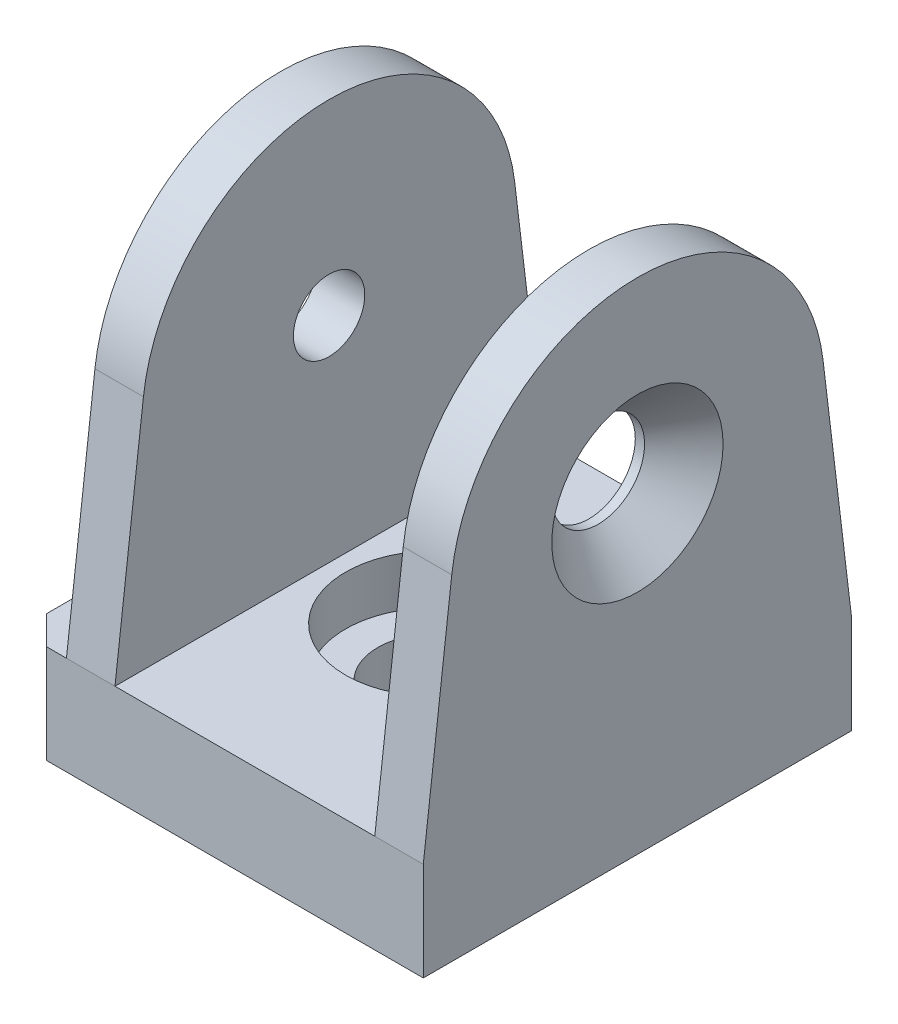
ISO-10303-21;
HEADER;
FILE_DESCRIPTION(('STEP AP214'),'2;1');
FILE_NAME('part.step','',(''),(''),'','','');
FILE_SCHEMA(('AUTOMOTIVE_DESIGN { 1 0 10303 214 1 1 1 1 }'));
ENDSEC;
DATA;
#1=APPLICATION_CONTEXT('core data for automotive mechanical design processes');
#2=APPLICATION_PROTOCOL_DEFINITION('international standard','automotive_design',2000,#1);
#3=PRODUCT_CONTEXT('',#1,'mechanical');
#4=PRODUCT('Part','Part','',(#3));
#5=PRODUCT_RELATED_PRODUCT_CATEGORY('part','',(#4));
#6=PRODUCT_DEFINITION_FORMATION('','',#4);
#7=PRODUCT_DEFINITION_CONTEXT('part definition',#1,'design');
#8=PRODUCT_DEFINITION('design','',#6,#7);
#9=PRODUCT_DEFINITION_SHAPE('','',#8);
#10=(LENGTH_UNIT() NAMED_UNIT(*) SI_UNIT(.MILLI.,.METRE.));
#11=(NAMED_UNIT(*) PLANE_ANGLE_UNIT() SI_UNIT($,.RADIAN.));
#12=(NAMED_UNIT(*) SI_UNIT($,.STERADIAN.) SOLID_ANGLE_UNIT());
#13=UNCERTAINTY_MEASURE_WITH_UNIT(LENGTH_MEASURE(1.E-05),#10,'distance_accuracy_value','');
#14=(GEOMETRIC_REPRESENTATION_CONTEXT(3) GLOBAL_UNCERTAINTY_ASSIGNED_CONTEXT((#13)) GLOBAL_UNIT_ASSIGNED_CONTEXT((#10,
#11,#12)) REPRESENTATION_CONTEXT('',''));
#15=CARTESIAN_POINT('',(0.,0.,0.));
#16=DIRECTION('',(0.,0.,1.));
#17=DIRECTION('',(1.,0.,0.));
#18=AXIS2_PLACEMENT_3D('',#15,#16,#17);
#19=CARTESIAN_POINT('',(-10.8,23.4654601413375,-13.0061268080041));
#20=DIRECTION('',(0.,0.119500774147898,-0.992834107481231));
#21=DIRECTION('',(0.,0.992834107481231,0.119500774147898));
#22=AXIS2_PLACEMENT_3D('',#19,#20,#21);
#23=PLANE('',#22);
#24=DIRECTION('',(0.,-0.992834107481231,-0.119500774147898));
#25=VECTOR('',#24,1.);
#26=CARTESIAN_POINT('',(10.8,23.4654601413375,-13.0061268080041));
#27=LINE('',#26,#25);
#28=CARTESIAN_POINT('',(10.8,23.4654601413374,-13.0061268080041));
#29=VERTEX_POINT('',#28);
#30=CARTESIAN_POINT('',(10.8,6.9,-15.));
#31=VERTEX_POINT('',#30);
#32=EDGE_CURVE('E144',#29,#31,#27,.T.);
#33=ORIENTED_EDGE('',*,*,#32,.F.);
#34=DIRECTION('',(1.,0.,0.));
#35=VECTOR('',#34,1.);
#36=CARTESIAN_POINT('',(-10.8,23.4654601413374,-13.0061268080041));
#37=LINE('',#36,#35);
#38=CARTESIAN_POINT('',(14.2,23.4654601413374,-13.0061268080041));
#39=VERTEX_POINT('',#38);
#40=EDGE_CURVE('E189',#29,#39,#37,.T.);
#41=ORIENTED_EDGE('',*,*,#40,.T.);
#42=DIRECTION('',(0.,0.992834107481231,0.119500774147898));
#43=VECTOR('',#42,1.);
#44=CARTESIAN_POINT('',(14.2,23.4654601413375,-13.0061268080041));
#45=LINE('',#44,#43);
#46=CARTESIAN_POINT('',(14.2,6.9,-15.));
#47=VERTEX_POINT('',#46);
#48=EDGE_CURVE('E257',#47,#39,#45,.T.);
#49=ORIENTED_EDGE('',*,*,#48,.F.);
#50=DIRECTION('',(-1.,0.,0.));
#51=VECTOR('',#50,1.);
#52=CARTESIAN_POINT('',(14.2,6.9,-15.));
#53=LINE('',#52,#51);
#54=EDGE_CURVE('E210',#47,#31,#53,.T.);
#55=ORIENTED_EDGE('',*,*,#54,.T.);
#56=EDGE_LOOP('',(#33,#41,#49,#55));
#57=FACE_BOUND('',#56,.T.);
#58=ADVANCED_FACE('F38',(#57),#23,.T.);
#59=CARTESIAN_POINT('',(-10.8,21.9,0.));
#60=DIRECTION('',(1.,0.,0.));
#61=DIRECTION('',(0.,0.,-1.));
#62=AXIS2_PLACEMENT_3D('',#59,#60,#61);
#63=CYLINDRICAL_SURFACE('',#62,13.1);
#64=DIRECTION('',(1.,0.,0.));
#65=VECTOR('',#64,1.);
#66=CARTESIAN_POINT('',(-10.8,23.4654601413375,13.0061268080041));
#67=LINE('',#66,#65);
#68=CARTESIAN_POINT('',(-10.8,23.4654601413375,13.0061268080041));
#69=VERTEX_POINT('',#68);
#70=CARTESIAN_POINT('',(-7.4,23.4654601413375,13.0061268080041));
#71=VERTEX_POINT('',#70);
#72=EDGE_CURVE('E177',#69,#71,#67,.T.);
#73=ORIENTED_EDGE('',*,*,#72,.T.);
#74=CARTESIAN_POINT('',(-7.4,21.9,0.));
#75=DIRECTION('',(-1.,0.,0.));
#76=DIRECTION('',(0.,-1.,0.));
#77=AXIS2_PLACEMENT_3D('',#74,#75,#76);
#78=CIRCLE('',#77,13.1);
#79=CARTESIAN_POINT('',(-7.4,23.4654601413374,-13.0061268080041));
#80=VERTEX_POINT('',#79);
#81=EDGE_CURVE('E148',#80,#71,#78,.F.);
#82=ORIENTED_EDGE('',*,*,#81,.F.);
#83=CARTESIAN_POINT('',(-10.8,23.4654601413374,-13.0061268080041));
#84=VERTEX_POINT('',#83);
#85=EDGE_CURVE('E186',#84,#80,#37,.T.);
#86=ORIENTED_EDGE('',*,*,#85,.F.);
#87=CARTESIAN_POINT('',(-10.8,21.9,0.));
#88=DIRECTION('',(1.,0.,0.));
#89=DIRECTION('',(0.,0.,1.));
#90=AXIS2_PLACEMENT_3D('',#87,#88,#89);
#91=CIRCLE('',#90,13.1);
#92=EDGE_CURVE('E312',#84,#69,#91,.T.);
#93=ORIENTED_EDGE('',*,*,#92,.T.);
#94=EDGE_LOOP('',(#73,#82,#86,#93));
#95=FACE_BOUND('',#94,.T.);
#96=ADVANCED_FACE('F272',(#95),#63,.T.);
#97=CARTESIAN_POINT('',(-10.8,6.9,15.));
#98=DIRECTION('',(0.,0.119500774147897,0.992834107481231));
#99=DIRECTION('',(0.,-0.992834107481231,0.119500774147897));
#100=AXIS2_PLACEMENT_3D('',#97,#98,#99);
#101=PLANE('',#100);
#102=DIRECTION('',(0.,0.992834107481231,-0.119500774147897));
#103=VECTOR('',#102,1.);
#104=CARTESIAN_POINT('',(10.8,6.9,15.));
#105=LINE('',#104,#103);
#106=CARTESIAN_POINT('',(10.8,6.9,15.));
#107=VERTEX_POINT('',#106);
#108=CARTESIAN_POINT('',(10.8,23.4654601413375,13.0061268080041));
#109=VERTEX_POINT('',#108);
#110=EDGE_CURVE('E141',#107,#109,#105,.T.);
#111=ORIENTED_EDGE('',*,*,#110,.F.);
#112=DIRECTION('',(1.,0.,0.));
#113=VECTOR('',#112,1.);
#114=CARTESIAN_POINT('',(-10.8,6.9,15.));
#115=LINE('',#114,#113);
#116=CARTESIAN_POINT('',(14.2,6.9,15.));
#117=VERTEX_POINT('',#116);
#118=EDGE_CURVE('E166',#107,#117,#115,.T.);
#119=ORIENTED_EDGE('',*,*,#118,.T.);
#120=DIRECTION('',(0.,-0.992834107481231,0.119500774147897));
#121=VECTOR('',#120,1.);
#122=CARTESIAN_POINT('',(14.2,6.9,15.));
#123=LINE('',#122,#121);
#124=CARTESIAN_POINT('',(14.2,23.4654601413375,13.0061268080041));
#125=VERTEX_POINT('',#124);
#126=EDGE_CURVE('E183',#125,#117,#123,.T.);
#127=ORIENTED_EDGE('',*,*,#126,.F.);
#128=EDGE_CURVE('E168',#109,#125,#67,.T.);
#129=ORIENTED_EDGE('',*,*,#128,.F.);
#130=EDGE_LOOP('',(#111,#119,#127,#129));
#131=FACE_BOUND('',#130,.T.);
#132=ADVANCED_FACE('F164',(#131),#101,.T.);
#133=CARTESIAN_POINT('',(0.,6.9,0.));
#134=DIRECTION('',(0.,1.,0.));
#135=DIRECTION('',(0.,0.,1.));
#136=AXIS2_PLACEMENT_3D('',#133,#134,#135);
#137=PLANE('',#136);
#138=CARTESIAN_POINT('',(-10.8,6.9,-15.));
#139=VERTEX_POINT('',#138);
#140=CARTESIAN_POINT('',(-12.2,6.9,-15.));
#141=VERTEX_POINT('',#140);
#142=EDGE_CURVE('E209',#139,#141,#53,.T.);
#143=ORIENTED_EDGE('',*,*,#142,.T.);
#144=DIRECTION('',(0.707106781186549,0.,-0.707106781186546));
#145=VECTOR('',#144,1.);
#146=CARTESIAN_POINT('',(-13.6,6.9,-13.6));
#147=LINE('',#146,#145);
#148=CARTESIAN_POINT('',(-14.2,6.9,-13.));
#149=VERTEX_POINT('',#148);
#150=EDGE_CURVE('E47',#141,#149,#147,.F.);
#151=ORIENTED_EDGE('',*,*,#150,.T.);
#152=DIRECTION('',(0.,0.,1.));
#153=VECTOR('',#152,1.);
#154=CARTESIAN_POINT('',(-14.2,6.9,15.));
#155=LINE('',#154,#153);
#156=CARTESIAN_POINT('',(-14.2,6.9,13.));
#157=VERTEX_POINT('',#156);
#158=EDGE_CURVE('E204',#149,#157,#155,.T.);
#159=ORIENTED_EDGE('',*,*,#158,.T.);
#160=DIRECTION('',(-0.707106781186547,0.,-0.707106781186548));
#161=VECTOR('',#160,1.);
#162=CARTESIAN_POINT('',(-13.6,6.9,13.6));
#163=LINE('',#162,#161);
#164=CARTESIAN_POINT('',(-12.2,6.9,15.));
#165=VERTEX_POINT('',#164);
#166=EDGE_CURVE('E54',#157,#165,#163,.F.);
#167=ORIENTED_EDGE('',*,*,#166,.T.);
#168=DIRECTION('',(1.,0.,0.));
#169=VECTOR('',#168,1.);
#170=CARTESIAN_POINT('',(14.2,6.9,15.));
#171=LINE('',#170,#169);
#172=CARTESIAN_POINT('',(-10.8,6.9,15.));
#173=VERTEX_POINT('',#172);
#174=EDGE_CURVE('E206',#165,#173,#171,.T.);
#175=ORIENTED_EDGE('',*,*,#174,.T.);
#176=DIRECTION('',(0.,0.,-1.));
#177=VECTOR('',#176,1.);
#178=CARTESIAN_POINT('',(-10.8,6.9,-15.));
#179=LINE('',#178,#177);
#180=EDGE_CURVE('E317',#173,#139,#179,.T.);
#181=ORIENTED_EDGE('',*,*,#180,.T.);
#182=EDGE_LOOP('',(#143,#151,#159,#167,#175,#181));
#183=FACE_BOUND('',#182,.T.);
#184=ADVANCED_FACE('F237',(#183),#137,.T.);
#185=CARTESIAN_POINT('',(-14.2,6.9,15.));
#186=DIRECTION('',(1.,0.,0.));
#187=DIRECTION('',(0.,0.,-1.));
#188=AXIS2_PLACEMENT_3D('',#185,#186,#187);
#189=PLANE('',#188);
#190=ORIENTED_EDGE('',*,*,#158,.F.);
#191=DIRECTION('',(0.,-1.,0.));
#192=VECTOR('',#191,1.);
#193=CARTESIAN_POINT('',(-14.2,6.9,-13.));
#194=LINE('',#193,#192);
#195=CARTESIAN_POINT('',(-14.2,0.,-13.));
#196=VERTEX_POINT('',#195);
#197=EDGE_CURVE('E227',#149,#196,#194,.T.);
#198=ORIENTED_EDGE('',*,*,#197,.T.);
#199=DIRECTION('',(0.,0.,1.));
#200=VECTOR('',#199,1.);
#201=CARTESIAN_POINT('',(-14.2,0.,15.));
#202=LINE('',#201,#200);
#203=CARTESIAN_POINT('',(-14.2,0.,13.));
#204=VERTEX_POINT('',#203);
#205=EDGE_CURVE('E203',#196,#204,#202,.T.);
#206=ORIENTED_EDGE('',*,*,#205,.T.);
#207=DIRECTION('',(0.,1.,0.));
#208=VECTOR('',#207,1.);
#209=CARTESIAN_POINT('',(-14.2,6.9,13.));
#210=LINE('',#209,#208);
#211=EDGE_CURVE('E169',#204,#157,#210,.T.);
#212=ORIENTED_EDGE('',*,*,#211,.T.);
#213=EDGE_LOOP('',(#190,#198,#206,#212));
#214=FACE_BOUND('',#213,.T.);
#215=ADVANCED_FACE('F242',(#214),#189,.F.);
#216=CARTESIAN_POINT('',(14.2,6.9,15.));
#217=DIRECTION('',(0.,0.,-1.));
#218=DIRECTION('',(-1.,0.,0.));
#219=AXIS2_PLACEMENT_3D('',#216,#217,#218);
#220=PLANE('',#219);
#221=ORIENTED_EDGE('',*,*,#174,.F.);
#222=DIRECTION('',(0.,-1.,0.));
#223=VECTOR('',#222,1.);
#224=CARTESIAN_POINT('',(-12.2,6.9,15.));
#225=LINE('',#224,#223);
#226=CARTESIAN_POINT('',(-12.2,0.,15.));
#227=VERTEX_POINT('',#226);
#228=EDGE_CURVE('E11',#165,#227,#225,.T.);
#229=ORIENTED_EDGE('',*,*,#228,.T.);
#230=DIRECTION('',(1.,0.,0.));
#231=VECTOR('',#230,1.);
#232=CARTESIAN_POINT('',(14.2,0.,15.));
#233=LINE('',#232,#231);
#234=CARTESIAN_POINT('',(14.2,0.,15.));
#235=VERTEX_POINT('',#234);
#236=EDGE_CURVE('E217',#227,#235,#233,.T.);
#237=ORIENTED_EDGE('',*,*,#236,.T.);
#238=DIRECTION('',(0.,-1.,0.));
#239=VECTOR('',#238,1.);
#240=CARTESIAN_POINT('',(14.2,6.9,15.));
#241=LINE('',#240,#239);
#242=EDGE_CURVE('E175',#117,#235,#241,.T.);
#243=ORIENTED_EDGE('',*,*,#242,.F.);
#244=ORIENTED_EDGE('',*,*,#118,.F.);
#245=DIRECTION('',(1.,0.,0.));
#246=VECTOR('',#245,1.);
#247=CARTESIAN_POINT('',(10.8,6.9,15.));
#248=LINE('',#247,#246);
#249=CARTESIAN_POINT('',(-7.4,6.9,15.));
#250=VERTEX_POINT('',#249);
#251=EDGE_CURVE('E152',#250,#107,#248,.T.);
#252=ORIENTED_EDGE('',*,*,#251,.F.);
#253=EDGE_CURVE('E176',#173,#250,#115,.T.);
#254=ORIENTED_EDGE('',*,*,#253,.F.);
#255=EDGE_LOOP('',(#221,#229,#237,#243,#244,#252,#254));
#256=FACE_BOUND('',#255,.T.);
#257=ADVANCED_FACE('F173',(#256),#220,.F.);
#258=CARTESIAN_POINT('',(14.2,6.9,15.));
#259=DIRECTION('',(-1.,0.,0.));
#260=DIRECTION('',(0.,0.,1.));
#261=AXIS2_PLACEMENT_3D('',#258,#259,#260);
#262=PLANE('',#261);
#263=CARTESIAN_POINT('',(14.2,21.9,0.));
#264=DIRECTION('',(1.,0.,0.));
#265=DIRECTION('',(0.,0.,-1.));
#266=AXIS2_PLACEMENT_3D('',#263,#264,#265);
#267=CIRCLE('',#266,6.);
#268=CARTESIAN_POINT('',(14.2,21.9,-6.));
#269=VERTEX_POINT('',#268);
#270=EDGE_CURVE('E333',#269,#269,#267,.T.);
#271=ORIENTED_EDGE('',*,*,#270,.F.);
#272=EDGE_LOOP('',(#271));
#273=FACE_BOUND('',#272,.T.);
#274=DIRECTION('',(0.,0.,-1.));
#275=VECTOR('',#274,1.);
#276=CARTESIAN_POINT('',(14.2,0.,15.));
#277=LINE('',#276,#275);
#278=CARTESIAN_POINT('',(14.2,0.,-15.));
#279=VERTEX_POINT('',#278);
#280=EDGE_CURVE('E219',#235,#279,#277,.T.);
#281=ORIENTED_EDGE('',*,*,#280,.T.);
#282=DIRECTION('',(0.,-1.,0.));
#283=VECTOR('',#282,1.);
#284=CARTESIAN_POINT('',(14.2,6.9,-15.));
#285=LINE('',#284,#283);
#286=EDGE_CURVE('E213',#47,#279,#285,.T.);
#287=ORIENTED_EDGE('',*,*,#286,.F.);
#288=ORIENTED_EDGE('',*,*,#48,.T.);
#289=CARTESIAN_POINT('',(14.2,21.9,0.));
#290=DIRECTION('',(1.,0.,0.));
#291=DIRECTION('',(0.,0.,1.));
#292=AXIS2_PLACEMENT_3D('',#289,#290,#291);
#293=CIRCLE('',#292,13.1);
#294=EDGE_CURVE('E305',#39,#125,#293,.T.);
#295=ORIENTED_EDGE('',*,*,#294,.T.);
#296=ORIENTED_EDGE('',*,*,#126,.T.);
#297=ORIENTED_EDGE('',*,*,#242,.T.);
#298=EDGE_LOOP('',(#281,#287,#288,#295,#296,#297));
#299=FACE_BOUND('',#298,.T.);
#300=ADVANCED_FACE('F255',(#273,#299),#262,.F.);
#301=CARTESIAN_POINT('',(14.2,6.9,-15.));
#302=DIRECTION('',(0.,0.,1.));
#303=DIRECTION('',(1.,0.,0.));
#304=AXIS2_PLACEMENT_3D('',#301,#302,#303);
#305=PLANE('',#304);
#306=DIRECTION('',(-1.,0.,0.));
#307=VECTOR('',#306,1.);
#308=CARTESIAN_POINT('',(14.2,0.,-15.));
#309=LINE('',#308,#307);
#310=CARTESIAN_POINT('',(-12.2,0.,-15.));
#311=VERTEX_POINT('',#310);
#312=EDGE_CURVE('E207',#279,#311,#309,.T.);
#313=ORIENTED_EDGE('',*,*,#312,.T.);
#314=DIRECTION('',(0.,1.,0.));
#315=VECTOR('',#314,1.);
#316=CARTESIAN_POINT('',(-12.2,6.9,-15.));
#317=LINE('',#316,#315);
#318=EDGE_CURVE('E62',#311,#141,#317,.T.);
#319=ORIENTED_EDGE('',*,*,#318,.T.);
#320=ORIENTED_EDGE('',*,*,#142,.F.);
#321=CARTESIAN_POINT('',(-7.4,6.9,-15.));
#322=VERTEX_POINT('',#321);
#323=EDGE_CURVE('E214',#322,#139,#53,.T.);
#324=ORIENTED_EDGE('',*,*,#323,.F.);
#325=DIRECTION('',(1.,0.,0.));
#326=VECTOR('',#325,1.);
#327=CARTESIAN_POINT('',(10.8,6.9,-15.));
#328=LINE('',#327,#326);
#329=EDGE_CURVE('E160',#322,#31,#328,.T.);
#330=ORIENTED_EDGE('',*,*,#329,.T.);
#331=ORIENTED_EDGE('',*,*,#54,.F.);
#332=ORIENTED_EDGE('',*,*,#286,.T.);
#333=EDGE_LOOP('',(#313,#319,#320,#324,#330,#331,#332));
#334=FACE_BOUND('',#333,.T.);
#335=ADVANCED_FACE('F250',(#334),#305,.F.);
#336=CARTESIAN_POINT('',(0.,0.,0.));
#337=DIRECTION('',(0.,1.,0.));
#338=DIRECTION('',(0.,0.,1.));
#339=AXIS2_PLACEMENT_3D('',#336,#337,#338);
#340=PLANE('',#339);
#341=CARTESIAN_POINT('',(0.,0.,0.));
#342=DIRECTION('',(0.,1.,0.));
#343=DIRECTION('',(0.,0.,1.));
#344=AXIS2_PLACEMENT_3D('',#341,#342,#343);
#345=CIRCLE('',#344,4.);
#346=CARTESIAN_POINT('',(0.,0.,4.));
#347=VERTEX_POINT('',#346);
#348=EDGE_CURVE('E200',#347,#347,#345,.T.);
#349=ORIENTED_EDGE('',*,*,#348,.T.);
#350=EDGE_LOOP('',(#349));
#351=FACE_BOUND('',#350,.T.);
#352=ORIENTED_EDGE('',*,*,#205,.F.);
#353=DIRECTION('',(-0.707106781186549,0.,0.707106781186546));
#354=VECTOR('',#353,1.);
#355=CARTESIAN_POINT('',(-14.2,0.,-13.));
#356=LINE('',#355,#354);
#357=EDGE_CURVE('E232',#196,#311,#356,.F.);
#358=ORIENTED_EDGE('',*,*,#357,.T.);
#359=ORIENTED_EDGE('',*,*,#312,.F.);
#360=ORIENTED_EDGE('',*,*,#280,.F.);
#361=ORIENTED_EDGE('',*,*,#236,.F.);
#362=DIRECTION('',(0.707106781186547,0.,0.707106781186548));
#363=VECTOR('',#362,1.);
#364=CARTESIAN_POINT('',(-12.2,0.,15.));
#365=LINE('',#364,#363);
#366=EDGE_CURVE('E230',#227,#204,#365,.F.);
#367=ORIENTED_EDGE('',*,*,#366,.T.);
#368=EDGE_LOOP('',(#352,#358,#359,#360,#361,#367));
#369=FACE_BOUND('',#368,.T.);
#370=ADVANCED_FACE('F248',(#351,#369),#340,.F.);
#371=CARTESIAN_POINT('',(0.,6.9,0.));
#372=DIRECTION('',(0.,1.,0.));
#373=DIRECTION('',(0.,0.,1.));
#374=AXIS2_PLACEMENT_3D('',#371,#372,#373);
#375=CYLINDRICAL_SURFACE('',#374,4.);
#376=ORIENTED_EDGE('',*,*,#348,.F.);
#377=EDGE_LOOP('',(#376));
#378=FACE_BOUND('',#377,.T.);
#379=CARTESIAN_POINT('',(0.,3.45,0.));
#380=DIRECTION('',(0.,1.,0.));
#381=DIRECTION('',(0.,0.,1.));
#382=AXIS2_PLACEMENT_3D('',#379,#380,#381);
#383=CIRCLE('',#382,4.);
#384=CARTESIAN_POINT('',(0.,3.45,4.));
#385=VERTEX_POINT('',#384);
#386=EDGE_CURVE('E197',#385,#385,#383,.T.);
#387=ORIENTED_EDGE('',*,*,#386,.T.);
#388=EDGE_LOOP('',(#387));
#389=FACE_BOUND('',#388,.T.);
#390=ADVANCED_FACE('F364',(#378,#389),#375,.F.);
#391=CARTESIAN_POINT('',(-4.,3.45,0.));
#392=DIRECTION('',(0.,-1.,0.));
#393=DIRECTION('',(0.,0.,-1.));
#394=AXIS2_PLACEMENT_3D('',#391,#392,#393);
#395=PLANE('',#394);
#396=ORIENTED_EDGE('',*,*,#386,.F.);
#397=EDGE_LOOP('',(#396));
#398=FACE_BOUND('',#397,.T.);
#399=CARTESIAN_POINT('',(0.,3.45,0.));
#400=DIRECTION('',(0.,1.,0.));
#401=DIRECTION('',(0.,0.,1.));
#402=AXIS2_PLACEMENT_3D('',#399,#400,#401);
#403=CIRCLE('',#402,6.25);
#404=CARTESIAN_POINT('',(0.,3.45,6.25));
#405=VERTEX_POINT('',#404);
#406=EDGE_CURVE('E179',#405,#405,#403,.T.);
#407=ORIENTED_EDGE('',*,*,#406,.T.);
#408=EDGE_LOOP('',(#407));
#409=FACE_BOUND('',#408,.T.);
#410=ADVANCED_FACE('F371',(#398,#409),#395,.F.);
#411=CARTESIAN_POINT('',(0.,6.9,0.));
#412=DIRECTION('',(0.,1.,0.));
#413=DIRECTION('',(0.,0.,1.));
#414=AXIS2_PLACEMENT_3D('',#411,#412,#413);
#415=CYLINDRICAL_SURFACE('',#414,6.25);
#416=ORIENTED_EDGE('',*,*,#406,.F.);
#417=EDGE_LOOP('',(#416));
#418=FACE_BOUND('',#417,.T.);
#419=CARTESIAN_POINT('',(0.,6.9,0.));
#420=DIRECTION('',(0.,1.,0.));
#421=DIRECTION('',(0.,0.,1.));
#422=AXIS2_PLACEMENT_3D('',#419,#420,#421);
#423=CIRCLE('',#422,6.25);
#424=CARTESIAN_POINT('',(0.,6.9,6.25));
#425=VERTEX_POINT('',#424);
#426=EDGE_CURVE('E190',#425,#425,#423,.T.);
#427=ORIENTED_EDGE('',*,*,#426,.T.);
#428=EDGE_LOOP('',(#427));
#429=FACE_BOUND('',#428,.T.);
#430=ADVANCED_FACE('F292',(#418,#429),#415,.F.);
#431=CARTESIAN_POINT('',(-10.8,21.9,0.));
#432=DIRECTION('',(-1.,0.,0.));
#433=DIRECTION('',(0.,0.,1.));
#434=AXIS2_PLACEMENT_3D('',#431,#432,#433);
#435=PLANE('',#434);
#436=CARTESIAN_POINT('',(-10.8,21.9,0.));
#437=DIRECTION('',(-1.,0.,0.));
#438=DIRECTION('',(0.,0.,1.));
#439=AXIS2_PLACEMENT_3D('',#436,#437,#438);
#440=CIRCLE('',#439,2.5);
#441=CARTESIAN_POINT('',(-10.8,21.9,2.5));
#442=VERTEX_POINT('',#441);
#443=EDGE_CURVE('E324',#442,#442,#440,.T.);
#444=ORIENTED_EDGE('',*,*,#443,.F.);
#445=EDGE_LOOP('',(#444));
#446=FACE_BOUND('',#445,.T.);
#447=ORIENTED_EDGE('',*,*,#180,.F.);
#448=DIRECTION('',(0.,-0.992834107481231,0.119500774147897));
#449=VECTOR('',#448,1.);
#450=CARTESIAN_POINT('',(-10.8,6.9,15.));
#451=LINE('',#450,#449);
#452=EDGE_CURVE('E309',#69,#173,#451,.T.);
#453=ORIENTED_EDGE('',*,*,#452,.F.);
#454=ORIENTED_EDGE('',*,*,#92,.F.);
#455=DIRECTION('',(0.,0.992834107481231,0.119500774147898));
#456=VECTOR('',#455,1.);
#457=CARTESIAN_POINT('',(-10.8,23.4654601413375,-13.0061268080041));
#458=LINE('',#457,#456);
#459=EDGE_CURVE('E315',#139,#84,#458,.T.);
#460=ORIENTED_EDGE('',*,*,#459,.F.);
#461=EDGE_LOOP('',(#447,#453,#454,#460));
#462=FACE_BOUND('',#461,.T.);
#463=ADVANCED_FACE('F284',(#446,#462),#435,.T.);
#464=DIRECTION('',(0.,0.992834107481231,0.119500774147898));
#465=VECTOR('',#464,1.);
#466=CARTESIAN_POINT('',(-7.4,23.4654601413375,-13.0061268080041));
#467=LINE('',#466,#465);
#468=EDGE_CURVE('E194',#322,#80,#467,.T.);
#469=ORIENTED_EDGE('',*,*,#468,.F.);
#470=ORIENTED_EDGE('',*,*,#323,.T.);
#471=ORIENTED_EDGE('',*,*,#459,.T.);
#472=ORIENTED_EDGE('',*,*,#85,.T.);
#473=EDGE_LOOP('',(#469,#470,#471,#472));
#474=FACE_BOUND('',#473,.T.);
#475=ADVANCED_FACE('F275',(#474),#23,.T.);
#476=CARTESIAN_POINT('',(10.8,21.9,0.));
#477=DIRECTION('',(1.,0.,0.));
#478=DIRECTION('',(0.,0.,-1.));
#479=AXIS2_PLACEMENT_3D('',#476,#477,#478);
#480=CIRCLE('',#479,13.1);
#481=EDGE_CURVE('E193',#109,#29,#480,.F.);
#482=ORIENTED_EDGE('',*,*,#481,.F.);
#483=ORIENTED_EDGE('',*,*,#128,.T.);
#484=ORIENTED_EDGE('',*,*,#294,.F.);
#485=ORIENTED_EDGE('',*,*,#40,.F.);
#486=EDGE_LOOP('',(#482,#483,#484,#485));
#487=FACE_BOUND('',#486,.T.);
#488=ADVANCED_FACE('F281',(#487),#63,.T.);
#489=DIRECTION('',(0.,-0.992834107481231,0.119500774147897));
#490=VECTOR('',#489,1.);
#491=CARTESIAN_POINT('',(-7.4,6.9,15.));
#492=LINE('',#491,#490);
#493=EDGE_CURVE('E170',#71,#250,#492,.T.);
#494=ORIENTED_EDGE('',*,*,#493,.F.);
#495=ORIENTED_EDGE('',*,*,#72,.F.);
#496=ORIENTED_EDGE('',*,*,#452,.T.);
#497=ORIENTED_EDGE('',*,*,#253,.T.);
#498=EDGE_LOOP('',(#494,#495,#496,#497));
#499=FACE_BOUND('',#498,.T.);
#500=ADVANCED_FACE('F290',(#499),#101,.T.);
#501=CARTESIAN_POINT('',(10.8,6.9,-15.));
#502=DIRECTION('',(0.,-1.,0.));
#503=DIRECTION('',(1.,0.,0.));
#504=AXIS2_PLACEMENT_3D('',#501,#502,#503);
#505=PLANE('',#504);
#506=DIRECTION('',(0.,0.,1.));
#507=VECTOR('',#506,1.);
#508=CARTESIAN_POINT('',(10.8,6.9,-15.));
#509=LINE('',#508,#507);
#510=EDGE_CURVE('E137',#31,#107,#509,.T.);
#511=ORIENTED_EDGE('',*,*,#510,.F.);
#512=ORIENTED_EDGE('',*,*,#329,.F.);
#513=DIRECTION('',(0.,0.,1.));
#514=VECTOR('',#513,1.);
#515=CARTESIAN_POINT('',(-7.4,6.9,-15.));
#516=LINE('',#515,#514);
#517=EDGE_CURVE('E149',#322,#250,#516,.T.);
#518=ORIENTED_EDGE('',*,*,#517,.T.);
#519=ORIENTED_EDGE('',*,*,#251,.T.);
#520=EDGE_LOOP('',(#511,#512,#518,#519));
#521=FACE_BOUND('',#520,.T.);
#522=ORIENTED_EDGE('',*,*,#426,.F.);
#523=EDGE_LOOP('',(#522));
#524=FACE_BOUND('',#523,.T.);
#525=ADVANCED_FACE('F153',(#521,#524),#505,.F.);
#526=CARTESIAN_POINT('',(10.8,6.9,-15.));
#527=DIRECTION('',(1.,0.,0.));
#528=DIRECTION('',(0.,0.,-1.));
#529=AXIS2_PLACEMENT_3D('',#526,#527,#528);
#530=PLANE('',#529);
#531=CARTESIAN_POINT('',(10.8,21.9,0.));
#532=DIRECTION('',(1.,0.,0.));
#533=DIRECTION('',(0.,0.,-1.));
#534=AXIS2_PLACEMENT_3D('',#531,#532,#533);
#535=CIRCLE('',#534,3.25);
#536=CARTESIAN_POINT('',(10.8,21.9,-3.25));
#537=VERTEX_POINT('',#536);
#538=EDGE_CURVE('E327',#537,#537,#535,.T.);
#539=ORIENTED_EDGE('',*,*,#538,.T.);
#540=EDGE_LOOP('',(#539));
#541=FACE_BOUND('',#540,.T.);
#542=ORIENTED_EDGE('',*,*,#32,.T.);
#543=ORIENTED_EDGE('',*,*,#510,.T.);
#544=ORIENTED_EDGE('',*,*,#110,.T.);
#545=ORIENTED_EDGE('',*,*,#481,.T.);
#546=EDGE_LOOP('',(#542,#543,#544,#545));
#547=FACE_BOUND('',#546,.T.);
#548=ADVANCED_FACE('F139',(#541,#547),#530,.F.);
#549=CARTESIAN_POINT('',(-7.4,6.9,-15.));
#550=DIRECTION('',(-1.,0.,0.));
#551=DIRECTION('',(0.,-1.,0.));
#552=AXIS2_PLACEMENT_3D('',#549,#550,#551);
#553=PLANE('',#552);
#554=CARTESIAN_POINT('',(-7.4,21.9,0.));
#555=DIRECTION('',(-1.,0.,0.));
#556=DIRECTION('',(0.,-1.,0.));
#557=AXIS2_PLACEMENT_3D('',#554,#555,#556);
#558=CIRCLE('',#557,2.5);
#559=CARTESIAN_POINT('',(-7.4,19.4,0.));
#560=VERTEX_POINT('',#559);
#561=EDGE_CURVE('E161',#560,#560,#558,.T.);
#562=ORIENTED_EDGE('',*,*,#561,.T.);
#563=EDGE_LOOP('',(#562));
#564=FACE_BOUND('',#563,.T.);
#565=ORIENTED_EDGE('',*,*,#468,.T.);
#566=ORIENTED_EDGE('',*,*,#81,.T.);
#567=ORIENTED_EDGE('',*,*,#493,.T.);
#568=ORIENTED_EDGE('',*,*,#517,.F.);
#569=EDGE_LOOP('',(#565,#566,#567,#568));
#570=FACE_BOUND('',#569,.T.);
#571=ADVANCED_FACE('F270',(#564,#570),#553,.F.);
#572=CARTESIAN_POINT('',(-14.2,6.9,-13.));
#573=DIRECTION('',(0.707106781186546,0.,0.707106781186549));
#574=DIRECTION('',(0.,-1.,0.));
#575=AXIS2_PLACEMENT_3D('',#572,#573,#574);
#576=PLANE('',#575);
#577=ORIENTED_EDGE('',*,*,#150,.F.);
#578=ORIENTED_EDGE('',*,*,#318,.F.);
#579=ORIENTED_EDGE('',*,*,#357,.F.);
#580=ORIENTED_EDGE('',*,*,#197,.F.);
#581=EDGE_LOOP('',(#577,#578,#579,#580));
#582=FACE_BOUND('',#581,.T.);
#583=ADVANCED_FACE('F245',(#582),#576,.F.);
#584=CARTESIAN_POINT('',(-12.2,6.9,15.));
#585=DIRECTION('',(0.707106781186548,0.,-0.707106781186547));
#586=DIRECTION('',(0.,-1.,0.));
#587=AXIS2_PLACEMENT_3D('',#584,#585,#586);
#588=PLANE('',#587);
#589=ORIENTED_EDGE('',*,*,#166,.F.);
#590=ORIENTED_EDGE('',*,*,#211,.F.);
#591=ORIENTED_EDGE('',*,*,#366,.F.);
#592=ORIENTED_EDGE('',*,*,#228,.F.);
#593=EDGE_LOOP('',(#589,#590,#591,#592));
#594=FACE_BOUND('',#593,.T.);
#595=ADVANCED_FACE('F41',(#594),#588,.F.);
#596=CARTESIAN_POINT('',(-10.8,21.9,0.));
#597=DIRECTION('',(-1.,0.,0.));
#598=DIRECTION('',(0.,0.,1.));
#599=AXIS2_PLACEMENT_3D('',#596,#597,#598);
#600=CYLINDRICAL_SURFACE('',#599,2.5);
#601=ORIENTED_EDGE('',*,*,#561,.F.);
#602=EDGE_LOOP('',(#601));
#603=FACE_BOUND('',#602,.T.);
#604=ORIENTED_EDGE('',*,*,#443,.T.);
#605=EDGE_LOOP('',(#604));
#606=FACE_BOUND('',#605,.T.);
#607=ADVANCED_FACE('F262',(#603,#606),#600,.F.);
#608=CARTESIAN_POINT('',(14.2,21.9,0.));
#609=DIRECTION('',(1.,0.,0.));
#610=DIRECTION('',(0.,0.,-1.));
#611=AXIS2_PLACEMENT_3D('',#608,#609,#610);
#612=CYLINDRICAL_SURFACE('',#611,3.25);
#613=ORIENTED_EDGE('',*,*,#538,.F.);
#614=EDGE_LOOP('',(#613));
#615=FACE_BOUND('',#614,.T.);
#616=CARTESIAN_POINT('',(11.45,21.9,0.));
#617=DIRECTION('',(1.,0.,0.));
#618=DIRECTION('',(0.,0.,-1.));
#619=AXIS2_PLACEMENT_3D('',#616,#617,#618);
#620=CIRCLE('',#619,3.25);
#621=CARTESIAN_POINT('',(11.45,21.9,-3.25));
#622=VERTEX_POINT('',#621);
#623=EDGE_CURVE('E330',#622,#622,#620,.T.);
#624=ORIENTED_EDGE('',*,*,#623,.T.);
#625=EDGE_LOOP('',(#624));
#626=FACE_BOUND('',#625,.T.);
#627=ADVANCED_FACE('F267',(#615,#626),#612,.F.);
#628=CARTESIAN_POINT('',(14.2,21.9,0.));
#629=DIRECTION('',(1.,0.,0.));
#630=DIRECTION('',(0.,0.,-1.));
#631=AXIS2_PLACEMENT_3D('',#628,#629,#630);
#632=CONICAL_SURFACE('',#631,6.,0.785398163397448);
#633=ORIENTED_EDGE('',*,*,#623,.F.);
#634=EDGE_LOOP('',(#633));
#635=FACE_BOUND('',#634,.T.);
#636=ORIENTED_EDGE('',*,*,#270,.T.);
#637=EDGE_LOOP('',(#636));
#638=FACE_BOUND('',#637,.T.);
#639=ADVANCED_FACE('F337',(#635,#638),#632,.F.);
#640=CLOSED_SHELL('',(#58,#96,#132,#184,#215,#257,#300,#335,#370,#390,#410,#430,#463,#475,#488,
#500,#525,#548,#571,#583,#595,#607,#627,#639));
#641=MANIFOLD_SOLID_BREP('B2',#640);
#642=ADVANCED_BREP_SHAPE_REPRESENTATION('',(#18,#641),#14);
#643=SHAPE_DEFINITION_REPRESENTATION(#9,#642);
ENDSEC;
END-ISO-10303-21;
